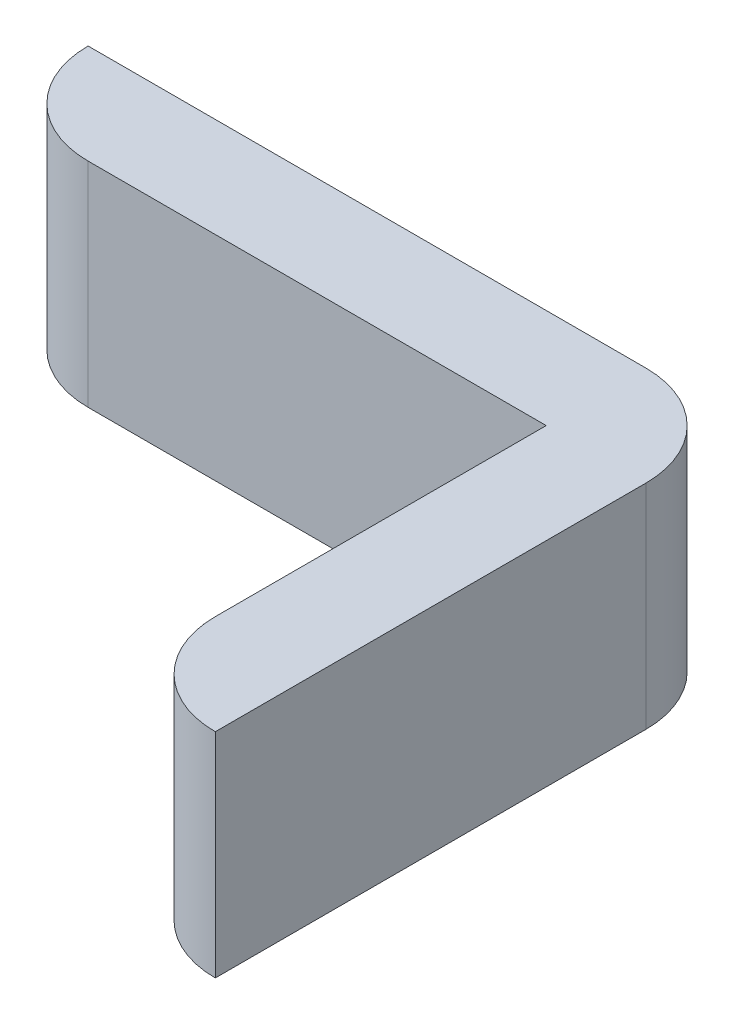
ISO-10303-21;
HEADER;
FILE_DESCRIPTION(('STEP AP214'),'2;1');
FILE_NAME('part.step','',(''),(''),'','','');
FILE_SCHEMA(('AUTOMOTIVE_DESIGN { 1 0 10303 214 1 1 1 1 }'));
ENDSEC;
DATA;
#1=APPLICATION_CONTEXT('core data for automotive mechanical design processes');
#2=APPLICATION_PROTOCOL_DEFINITION('international standard','automotive_design',2000,#1);
#3=PRODUCT_CONTEXT('',#1,'mechanical');
#4=PRODUCT('Part','Part','',(#3));
#5=PRODUCT_RELATED_PRODUCT_CATEGORY('part','',(#4));
#6=PRODUCT_DEFINITION_FORMATION('','',#4);
#7=PRODUCT_DEFINITION_CONTEXT('part definition',#1,'design');
#8=PRODUCT_DEFINITION('design','',#6,#7);
#9=PRODUCT_DEFINITION_SHAPE('','',#8);
#10=(LENGTH_UNIT() NAMED_UNIT(*) SI_UNIT(.MILLI.,.METRE.));
#11=(NAMED_UNIT(*) PLANE_ANGLE_UNIT() SI_UNIT($,.RADIAN.));
#12=(NAMED_UNIT(*) SI_UNIT($,.STERADIAN.) SOLID_ANGLE_UNIT());
#13=UNCERTAINTY_MEASURE_WITH_UNIT(LENGTH_MEASURE(1.E-05),#10,'distance_accuracy_value','');
#14=(GEOMETRIC_REPRESENTATION_CONTEXT(3) GLOBAL_UNCERTAINTY_ASSIGNED_CONTEXT((#13)) GLOBAL_UNIT_ASSIGNED_CONTEXT((#10,
#11,#12)) REPRESENTATION_CONTEXT('',''));
#15=CARTESIAN_POINT('',(0.,0.,0.));
#16=DIRECTION('',(0.,0.,1.));
#17=DIRECTION('',(1.,0.,0.));
#18=AXIS2_PLACEMENT_3D('',#15,#16,#17);
#19=CARTESIAN_POINT('',(-1.0795,1.6375,1.33));
#20=DIRECTION('',(-1.,0.,0.));
#21=DIRECTION('',(0.,0.,1.));
#22=AXIS2_PLACEMENT_3D('',#19,#20,#21);
#23=PLANE('',#22);
#24=DIRECTION('',(0.,0.,-1.));
#25=VECTOR('',#24,1.);
#26=CARTESIAN_POINT('',(-1.0795,1.6375,0.));
#27=LINE('',#26,#25);
#28=CARTESIAN_POINT('',(-1.0795,1.6375,0.25));
#29=VERTEX_POINT('',#28);
#30=CARTESIAN_POINT('',(-1.0795,1.6375,1.33));
#31=VERTEX_POINT('',#30);
#32=EDGE_CURVE('E129',#29,#31,#27,.F.);
#33=ORIENTED_EDGE('',*,*,#32,.F.);
#34=DIRECTION('',(0.,-1.,0.));
#35=VECTOR('',#34,1.);
#36=CARTESIAN_POINT('',(-1.0795,1.6375,0.25));
#37=LINE('',#36,#35);
#38=CARTESIAN_POINT('',(-1.0795,2.1725,0.25));
#39=VERTEX_POINT('',#38);
#40=EDGE_CURVE('E82',#39,#29,#37,.T.);
#41=ORIENTED_EDGE('',*,*,#40,.F.);
#42=DIRECTION('',(0.,0.,-1.));
#43=VECTOR('',#42,1.);
#44=CARTESIAN_POINT('',(-1.0795,2.1725,0.));
#45=LINE('',#44,#43);
#46=CARTESIAN_POINT('',(-1.0795,2.1725,1.33));
#47=VERTEX_POINT('',#46);
#48=EDGE_CURVE('E77',#39,#47,#45,.F.);
#49=ORIENTED_EDGE('',*,*,#48,.T.);
#50=DIRECTION('',(0.,-1.,0.));
#51=VECTOR('',#50,1.);
#52=CARTESIAN_POINT('',(-1.0795,1.6375,1.33));
#53=LINE('',#52,#51);
#54=EDGE_CURVE('E123',#31,#47,#53,.F.);
#55=ORIENTED_EDGE('',*,*,#54,.F.);
#56=EDGE_LOOP('',(#33,#41,#49,#55));
#57=FACE_BOUND('',#56,.T.);
#58=ADVANCED_FACE('F17',(#57),#23,.F.);
#59=CARTESIAN_POINT('',(-1.0795,1.6375,1.08));
#60=DIRECTION('',(0.,-1.,0.));
#61=DIRECTION('',(0.,0.,-1.));
#62=AXIS2_PLACEMENT_3D('',#59,#60,#61);
#63=CYLINDRICAL_SURFACE('',#62,0.25);
#64=CARTESIAN_POINT('',(-1.0795,2.1725,1.08));
#65=DIRECTION('',(0.,-1.,0.));
#66=DIRECTION('',(0.,0.,-1.));
#67=AXIS2_PLACEMENT_3D('',#64,#65,#66);
#68=CIRCLE('',#67,0.25);
#69=CARTESIAN_POINT('',(-1.3295,2.1725,1.08));
#70=VERTEX_POINT('',#69);
#71=EDGE_CURVE('E107',#47,#70,#68,.T.);
#72=ORIENTED_EDGE('',*,*,#71,.T.);
#73=DIRECTION('',(0.,1.,0.));
#74=VECTOR('',#73,1.);
#75=CARTESIAN_POINT('',(-1.3295,1.6375,1.08));
#76=LINE('',#75,#74);
#77=CARTESIAN_POINT('',(-1.3295,1.6375,1.08));
#78=VERTEX_POINT('',#77);
#79=EDGE_CURVE('E118',#70,#78,#76,.F.);
#80=ORIENTED_EDGE('',*,*,#79,.T.);
#81=CARTESIAN_POINT('',(-1.0795,1.6375,1.08));
#82=DIRECTION('',(0.,-1.,0.));
#83=DIRECTION('',(0.,0.,-1.));
#84=AXIS2_PLACEMENT_3D('',#81,#82,#83);
#85=CIRCLE('',#84,0.25);
#86=EDGE_CURVE('E126',#31,#78,#85,.T.);
#87=ORIENTED_EDGE('',*,*,#86,.F.);
#88=ORIENTED_EDGE('',*,*,#54,.T.);
#89=EDGE_LOOP('',(#72,#80,#87,#88));
#90=FACE_BOUND('',#89,.T.);
#91=ADVANCED_FACE('F133',(#90),#63,.T.);
#92=CARTESIAN_POINT('',(-1.3295,1.6375,0.25));
#93=DIRECTION('',(1.,0.,0.));
#94=DIRECTION('',(0.,0.,-1.));
#95=AXIS2_PLACEMENT_3D('',#92,#93,#94);
#96=PLANE('',#95);
#97=ORIENTED_EDGE('',*,*,#79,.F.);
#98=DIRECTION('',(0.,0.,-1.));
#99=VECTOR('',#98,1.);
#100=CARTESIAN_POINT('',(-1.3295,2.1725,0.));
#101=LINE('',#100,#99);
#102=CARTESIAN_POINT('',(-1.3295,2.1725,0.25));
#103=VERTEX_POINT('',#102);
#104=EDGE_CURVE('E102',#70,#103,#101,.T.);
#105=ORIENTED_EDGE('',*,*,#104,.T.);
#106=DIRECTION('',(0.,1.,0.));
#107=VECTOR('',#106,1.);
#108=CARTESIAN_POINT('',(-1.3295,1.6375,0.25));
#109=LINE('',#108,#107);
#110=CARTESIAN_POINT('',(-1.3295,1.6375,0.25));
#111=VERTEX_POINT('',#110);
#112=EDGE_CURVE('E115',#103,#111,#109,.F.);
#113=ORIENTED_EDGE('',*,*,#112,.T.);
#114=DIRECTION('',(0.,0.,-1.));
#115=VECTOR('',#114,1.);
#116=CARTESIAN_POINT('',(-1.3295,1.6375,0.));
#117=LINE('',#116,#115);
#118=EDGE_CURVE('E128',#78,#111,#117,.T.);
#119=ORIENTED_EDGE('',*,*,#118,.F.);
#120=EDGE_LOOP('',(#97,#105,#113,#119));
#121=FACE_BOUND('',#120,.T.);
#122=ADVANCED_FACE('F158',(#121),#96,.F.);
#123=CARTESIAN_POINT('',(-2.4785,1.6375,0.25));
#124=DIRECTION('',(0.,0.,-1.));
#125=DIRECTION('',(-1.,0.,0.));
#126=AXIS2_PLACEMENT_3D('',#123,#124,#125);
#127=PLANE('',#126);
#128=ORIENTED_EDGE('',*,*,#112,.F.);
#129=DIRECTION('',(1.,0.,0.));
#130=VECTOR('',#129,1.);
#131=CARTESIAN_POINT('',(-2.7285,2.1725,0.25));
#132=LINE('',#131,#130);
#133=CARTESIAN_POINT('',(-2.4785,2.1725,0.25));
#134=VERTEX_POINT('',#133);
#135=EDGE_CURVE('E98',#103,#134,#132,.F.);
#136=ORIENTED_EDGE('',*,*,#135,.T.);
#137=DIRECTION('',(0.,-1.,0.));
#138=VECTOR('',#137,1.);
#139=CARTESIAN_POINT('',(-2.4785,1.6375,0.25));
#140=LINE('',#139,#138);
#141=CARTESIAN_POINT('',(-2.4785,1.6375,0.25));
#142=VERTEX_POINT('',#141);
#143=EDGE_CURVE('E101',#142,#134,#140,.F.);
#144=ORIENTED_EDGE('',*,*,#143,.F.);
#145=DIRECTION('',(1.,0.,0.));
#146=VECTOR('',#145,1.);
#147=CARTESIAN_POINT('',(-2.7285,1.6375,0.25));
#148=LINE('',#147,#146);
#149=EDGE_CURVE('E94',#111,#142,#148,.F.);
#150=ORIENTED_EDGE('',*,*,#149,.F.);
#151=EDGE_LOOP('',(#128,#136,#144,#150));
#152=FACE_BOUND('',#151,.T.);
#153=ADVANCED_FACE('F156',(#152),#127,.F.);
#154=CARTESIAN_POINT('',(-1.3295,1.6375,0.25));
#155=DIRECTION('',(0.,-1.,0.));
#156=DIRECTION('',(0.,0.,-1.));
#157=AXIS2_PLACEMENT_3D('',#154,#155,#156);
#158=CYLINDRICAL_SURFACE('',#157,0.25);
#159=CARTESIAN_POINT('',(-1.3295,2.1725,0.25));
#160=DIRECTION('',(0.,-1.,0.));
#161=DIRECTION('',(0.,0.,-1.));
#162=AXIS2_PLACEMENT_3D('',#159,#160,#161);
#163=CIRCLE('',#162,0.25);
#164=CARTESIAN_POINT('',(-1.3295,2.1725,0.));
#165=VERTEX_POINT('',#164);
#166=EDGE_CURVE('E20',#165,#39,#163,.T.);
#167=ORIENTED_EDGE('',*,*,#166,.T.);
#168=ORIENTED_EDGE('',*,*,#40,.T.);
#169=CARTESIAN_POINT('',(-1.3295,1.6375,0.25));
#170=DIRECTION('',(0.,-1.,0.));
#171=DIRECTION('',(0.,0.,-1.));
#172=AXIS2_PLACEMENT_3D('',#169,#170,#171);
#173=CIRCLE('',#172,0.25);
#174=CARTESIAN_POINT('',(-1.3295,1.6375,0.));
#175=VERTEX_POINT('',#174);
#176=EDGE_CURVE('E92',#175,#29,#173,.T.);
#177=ORIENTED_EDGE('',*,*,#176,.F.);
#178=DIRECTION('',(0.,1.,0.));
#179=VECTOR('',#178,1.);
#180=CARTESIAN_POINT('',(-1.3295,1.6375,0.));
#181=LINE('',#180,#179);
#182=EDGE_CURVE('E86',#175,#165,#181,.T.);
#183=ORIENTED_EDGE('',*,*,#182,.T.);
#184=EDGE_LOOP('',(#167,#168,#177,#183));
#185=FACE_BOUND('',#184,.T.);
#186=ADVANCED_FACE('F90',(#185),#158,.T.);
#187=CARTESIAN_POINT('',(-2.7285,2.1725,0.));
#188=DIRECTION('',(0.,-1.,0.));
#189=DIRECTION('',(0.,0.,-1.));
#190=AXIS2_PLACEMENT_3D('',#187,#188,#189);
#191=PLANE('',#190);
#192=ORIENTED_EDGE('',*,*,#135,.F.);
#193=ORIENTED_EDGE('',*,*,#104,.F.);
#194=ORIENTED_EDGE('',*,*,#71,.F.);
#195=ORIENTED_EDGE('',*,*,#48,.F.);
#196=ORIENTED_EDGE('',*,*,#166,.F.);
#197=DIRECTION('',(1.,0.,0.));
#198=VECTOR('',#197,1.);
#199=CARTESIAN_POINT('',(-1.3295,2.1725,0.));
#200=LINE('',#199,#198);
#201=CARTESIAN_POINT('',(-2.7285,2.1725,0.));
#202=VERTEX_POINT('',#201);
#203=EDGE_CURVE('E74',#165,#202,#200,.F.);
#204=ORIENTED_EDGE('',*,*,#203,.T.);
#205=CARTESIAN_POINT('',(-2.4785,2.1725,0.));
#206=DIRECTION('',(0.,-1.,0.));
#207=DIRECTION('',(0.,0.,-1.));
#208=AXIS2_PLACEMENT_3D('',#205,#206,#207);
#209=CIRCLE('',#208,0.25);
#210=EDGE_CURVE('E114',#134,#202,#209,.T.);
#211=ORIENTED_EDGE('',*,*,#210,.F.);
#212=EDGE_LOOP('',(#192,#193,#194,#195,#196,#204,#211));
#213=FACE_BOUND('',#212,.T.);
#214=ADVANCED_FACE('F72',(#213),#191,.F.);
#215=CARTESIAN_POINT('',(-2.4785,1.6375,0.));
#216=DIRECTION('',(0.,-1.,0.));
#217=DIRECTION('',(0.,0.,-1.));
#218=AXIS2_PLACEMENT_3D('',#215,#216,#217);
#219=CYLINDRICAL_SURFACE('',#218,0.25);
#220=ORIENTED_EDGE('',*,*,#210,.T.);
#221=DIRECTION('',(0.,1.,0.));
#222=VECTOR('',#221,1.);
#223=CARTESIAN_POINT('',(-2.7285,1.6375,0.));
#224=LINE('',#223,#222);
#225=CARTESIAN_POINT('',(-2.7285,1.6375,0.));
#226=VERTEX_POINT('',#225);
#227=EDGE_CURVE('E26',#202,#226,#224,.F.);
#228=ORIENTED_EDGE('',*,*,#227,.T.);
#229=CARTESIAN_POINT('',(-2.4785,1.6375,0.));
#230=DIRECTION('',(0.,-1.,0.));
#231=DIRECTION('',(0.,0.,-1.));
#232=AXIS2_PLACEMENT_3D('',#229,#230,#231);
#233=CIRCLE('',#232,0.25);
#234=EDGE_CURVE('E34',#142,#226,#233,.T.);
#235=ORIENTED_EDGE('',*,*,#234,.F.);
#236=ORIENTED_EDGE('',*,*,#143,.T.);
#237=EDGE_LOOP('',(#220,#228,#235,#236));
#238=FACE_BOUND('',#237,.T.);
#239=ADVANCED_FACE('F141',(#238),#219,.T.);
#240=CARTESIAN_POINT('',(-2.7285,1.6375,0.));
#241=DIRECTION('',(0.,-1.,0.));
#242=DIRECTION('',(0.,0.,-1.));
#243=AXIS2_PLACEMENT_3D('',#240,#241,#242);
#244=PLANE('',#243);
#245=ORIENTED_EDGE('',*,*,#149,.T.);
#246=ORIENTED_EDGE('',*,*,#234,.T.);
#247=DIRECTION('',(1.,0.,0.));
#248=VECTOR('',#247,1.);
#249=CARTESIAN_POINT('',(-1.3295,1.6375,0.));
#250=LINE('',#249,#248);
#251=EDGE_CURVE('E11',#226,#175,#250,.T.);
#252=ORIENTED_EDGE('',*,*,#251,.T.);
#253=ORIENTED_EDGE('',*,*,#176,.T.);
#254=ORIENTED_EDGE('',*,*,#32,.T.);
#255=ORIENTED_EDGE('',*,*,#86,.T.);
#256=ORIENTED_EDGE('',*,*,#118,.T.);
#257=EDGE_LOOP('',(#245,#246,#252,#253,#254,#255,#256));
#258=FACE_BOUND('',#257,.T.);
#259=ADVANCED_FACE('F139',(#258),#244,.T.);
#260=CARTESIAN_POINT('',(-1.3295,1.6375,0.));
#261=DIRECTION('',(0.,0.,1.));
#262=DIRECTION('',(1.,0.,0.));
#263=AXIS2_PLACEMENT_3D('',#260,#261,#262);
#264=PLANE('',#263);
#265=ORIENTED_EDGE('',*,*,#227,.F.);
#266=ORIENTED_EDGE('',*,*,#203,.F.);
#267=ORIENTED_EDGE('',*,*,#182,.F.);
#268=ORIENTED_EDGE('',*,*,#251,.F.);
#269=EDGE_LOOP('',(#265,#266,#267,#268));
#270=FACE_BOUND('',#269,.T.);
#271=ADVANCED_FACE('F85',(#270),#264,.F.);
#272=CLOSED_SHELL('',(#58,#91,#122,#153,#186,#214,#239,#259,#271));
#273=MANIFOLD_SOLID_BREP('B1',#272);
#274=ADVANCED_BREP_SHAPE_REPRESENTATION('',(#18,#273),#14);
#275=SHAPE_DEFINITION_REPRESENTATION(#9,#274);
ENDSEC;
END-ISO-10303-21;
